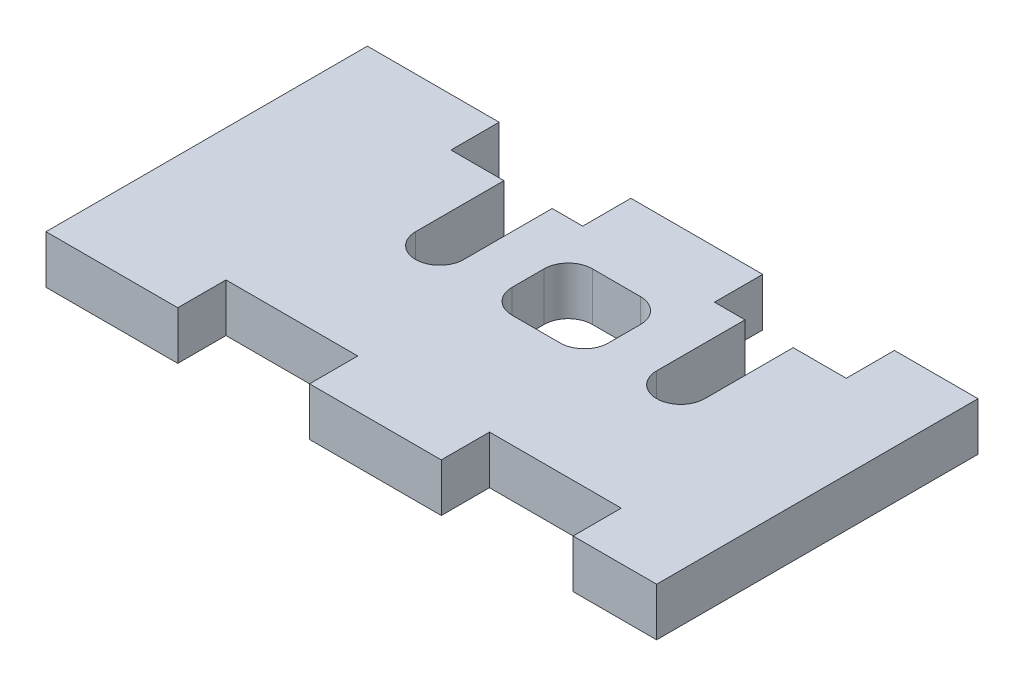
ISO-10303-21;
HEADER;
FILE_DESCRIPTION(('STEP AP214'),'2;1');
FILE_NAME('part.step','',(''),(''),'','','');
FILE_SCHEMA(('AUTOMOTIVE_DESIGN { 1 0 10303 214 1 1 1 1 }'));
ENDSEC;
DATA;
#1=APPLICATION_CONTEXT('core data for automotive mechanical design processes');
#2=APPLICATION_PROTOCOL_DEFINITION('international standard','automotive_design',2000,#1);
#3=PRODUCT_CONTEXT('',#1,'mechanical');
#4=PRODUCT('Part','Part','',(#3));
#5=PRODUCT_RELATED_PRODUCT_CATEGORY('part','',(#4));
#6=PRODUCT_DEFINITION_FORMATION('','',#4);
#7=PRODUCT_DEFINITION_CONTEXT('part definition',#1,'design');
#8=PRODUCT_DEFINITION('design','',#6,#7);
#9=PRODUCT_DEFINITION_SHAPE('','',#8);
#10=(LENGTH_UNIT() NAMED_UNIT(*) SI_UNIT(.MILLI.,.METRE.));
#11=(NAMED_UNIT(*) PLANE_ANGLE_UNIT() SI_UNIT($,.RADIAN.));
#12=(NAMED_UNIT(*) SI_UNIT($,.STERADIAN.) SOLID_ANGLE_UNIT());
#13=UNCERTAINTY_MEASURE_WITH_UNIT(LENGTH_MEASURE(1.E-05),#10,'distance_accuracy_value','');
#14=(GEOMETRIC_REPRESENTATION_CONTEXT(3) GLOBAL_UNCERTAINTY_ASSIGNED_CONTEXT((#13)) GLOBAL_UNIT_ASSIGNED_CONTEXT((#10,
#11,#12)) REPRESENTATION_CONTEXT('',''));
#15=CARTESIAN_POINT('',(0.,0.,0.));
#16=DIRECTION('',(0.,0.,1.));
#17=DIRECTION('',(1.,0.,0.));
#18=AXIS2_PLACEMENT_3D('',#15,#16,#17);
#19=CARTESIAN_POINT('',(24.599646,3.,-17.000006));
#20=DIRECTION('',(0.,0.,1.));
#21=DIRECTION('',(1.,0.,0.));
#22=AXIS2_PLACEMENT_3D('',#19,#20,#21);
#23=PLANE('',#22);
#24=DIRECTION('',(-1.,0.,0.));
#25=VECTOR('',#24,1.);
#26=CARTESIAN_POINT('',(24.599646,3.,-17.000006));
#27=LINE('',#26,#25);
#28=CARTESIAN_POINT('',(26.499959,3.,-17.000006));
#29=VERTEX_POINT('',#28);
#30=CARTESIAN_POINT('',(24.599646,3.,-17.000006));
#31=VERTEX_POINT('',#30);
#32=EDGE_CURVE('E472',#29,#31,#27,.T.);
#33=ORIENTED_EDGE('',*,*,#32,.F.);
#34=DIRECTION('',(0.,1.,0.));
#35=VECTOR('',#34,1.);
#36=CARTESIAN_POINT('',(26.499959,3.001,-17.000006));
#37=LINE('',#36,#35);
#38=CARTESIAN_POINT('',(26.499959,0.,-17.000006));
#39=VERTEX_POINT('',#38);
#40=EDGE_CURVE('E681',#39,#29,#37,.T.);
#41=ORIENTED_EDGE('',*,*,#40,.F.);
#42=DIRECTION('',(-1.,0.,0.));
#43=VECTOR('',#42,1.);
#44=CARTESIAN_POINT('',(24.599646,0.,-17.000006));
#45=LINE('',#44,#43);
#46=CARTESIAN_POINT('',(24.599646,0.,-17.000006));
#47=VERTEX_POINT('',#46);
#48=EDGE_CURVE('E395',#39,#47,#45,.T.);
#49=ORIENTED_EDGE('',*,*,#48,.T.);
#50=DIRECTION('',(0.,-1.,0.));
#51=VECTOR('',#50,1.);
#52=CARTESIAN_POINT('',(24.599646,3.,-17.000006));
#53=LINE('',#52,#51);
#54=EDGE_CURVE('E321',#31,#47,#53,.T.);
#55=ORIENTED_EDGE('',*,*,#54,.F.);
#56=EDGE_LOOP('',(#33,#41,#49,#55));
#57=FACE_BOUND('',#56,.T.);
#58=ADVANCED_FACE('F32',(#57),#23,.F.);
#59=CARTESIAN_POINT('',(8.19937400000001,3.,-17.000006));
#60=DIRECTION('',(0.,0.,1.));
#61=DIRECTION('',(1.,0.,0.));
#62=AXIS2_PLACEMENT_3D('',#59,#60,#61);
#63=PLANE('',#62);
#64=DIRECTION('',(-1.,0.,0.));
#65=VECTOR('',#64,1.);
#66=CARTESIAN_POINT('',(8.19937400000001,0.,-17.000006));
#67=LINE('',#66,#65);
#68=CARTESIAN_POINT('',(16.400272,0.,-17.000006));
#69=VERTEX_POINT('',#68);
#70=CARTESIAN_POINT('',(14.499959,0.,-17.000006));
#71=VERTEX_POINT('',#70);
#72=EDGE_CURVE('E291',#69,#71,#67,.T.);
#73=ORIENTED_EDGE('',*,*,#72,.T.);
#74=DIRECTION('',(0.,-1.,0.));
#75=VECTOR('',#74,1.);
#76=CARTESIAN_POINT('',(14.499959,3.001,-17.000006));
#77=LINE('',#76,#75);
#78=CARTESIAN_POINT('',(14.499959,3.,-17.000006));
#79=VERTEX_POINT('',#78);
#80=EDGE_CURVE('E282',#79,#71,#77,.T.);
#81=ORIENTED_EDGE('',*,*,#80,.F.);
#82=DIRECTION('',(-1.,0.,0.));
#83=VECTOR('',#82,1.);
#84=CARTESIAN_POINT('',(8.19937400000001,3.,-17.000006));
#85=LINE('',#84,#83);
#86=CARTESIAN_POINT('',(16.400272,3.,-17.000006));
#87=VERTEX_POINT('',#86);
#88=EDGE_CURVE('E421',#87,#79,#85,.T.);
#89=ORIENTED_EDGE('',*,*,#88,.F.);
#90=DIRECTION('',(0.,-1.,0.));
#91=VECTOR('',#90,1.);
#92=CARTESIAN_POINT('',(16.400272,3.,-17.000006));
#93=LINE('',#92,#91);
#94=EDGE_CURVE('E312',#87,#69,#93,.T.);
#95=ORIENTED_EDGE('',*,*,#94,.T.);
#96=EDGE_LOOP('',(#73,#81,#89,#95));
#97=FACE_BOUND('',#96,.T.);
#98=ADVANCED_FACE('F418',(#97),#63,.F.);
#99=CARTESIAN_POINT('',(0.,3.,0.));
#100=DIRECTION('',(1.,0.,0.));
#101=DIRECTION('',(0.,0.,-1.));
#102=AXIS2_PLACEMENT_3D('',#99,#100,#101);
#103=PLANE('',#102);
#104=DIRECTION('',(0.,0.,1.));
#105=VECTOR('',#104,1.);
#106=CARTESIAN_POINT('',(0.,0.,0.));
#107=LINE('',#106,#105);
#108=CARTESIAN_POINT('',(0.,0.,-20.));
#109=VERTEX_POINT('',#108);
#110=CARTESIAN_POINT('',(0.,0.,0.));
#111=VERTEX_POINT('',#110);
#112=EDGE_CURVE('E374',#109,#111,#107,.T.);
#113=ORIENTED_EDGE('',*,*,#112,.T.);
#114=DIRECTION('',(0.,-1.,0.));
#115=VECTOR('',#114,1.);
#116=CARTESIAN_POINT('',(0.,3.,0.));
#117=LINE('',#116,#115);
#118=CARTESIAN_POINT('',(0.,3.,0.));
#119=VERTEX_POINT('',#118);
#120=EDGE_CURVE('E11',#119,#111,#117,.T.);
#121=ORIENTED_EDGE('',*,*,#120,.F.);
#122=DIRECTION('',(0.,0.,1.));
#123=VECTOR('',#122,1.);
#124=CARTESIAN_POINT('',(0.,3.,0.));
#125=LINE('',#124,#123);
#126=CARTESIAN_POINT('',(0.,3.,-20.));
#127=VERTEX_POINT('',#126);
#128=EDGE_CURVE('E302',#127,#119,#125,.T.);
#129=ORIENTED_EDGE('',*,*,#128,.F.);
#130=DIRECTION('',(0.,-1.,0.));
#131=VECTOR('',#130,1.);
#132=CARTESIAN_POINT('',(0.,3.,-20.));
#133=LINE('',#132,#131);
#134=EDGE_CURVE('E303',#127,#109,#133,.T.);
#135=ORIENTED_EDGE('',*,*,#134,.T.);
#136=EDGE_LOOP('',(#113,#121,#129,#135));
#137=FACE_BOUND('',#136,.T.);
#138=ADVANCED_FACE('F34',(#137),#103,.F.);
#139=CARTESIAN_POINT('',(0.,3.,0.));
#140=DIRECTION('',(0.,0.,-1.));
#141=DIRECTION('',(-1.,0.,0.));
#142=AXIS2_PLACEMENT_3D('',#139,#140,#141);
#143=PLANE('',#142);
#144=DIRECTION('',(1.,0.,0.));
#145=VECTOR('',#144,1.);
#146=CARTESIAN_POINT('',(0.,0.,0.));
#147=LINE('',#146,#145);
#148=CARTESIAN_POINT('',(8.19937400000001,0.,0.));
#149=VERTEX_POINT('',#148);
#150=EDGE_CURVE('E368',#111,#149,#147,.T.);
#151=ORIENTED_EDGE('',*,*,#150,.T.);
#152=DIRECTION('',(0.,-1.,0.));
#153=VECTOR('',#152,1.);
#154=CARTESIAN_POINT('',(8.19937400000001,3.,0.));
#155=LINE('',#154,#153);
#156=CARTESIAN_POINT('',(8.19937400000001,3.,0.));
#157=VERTEX_POINT('',#156);
#158=EDGE_CURVE('E40',#157,#149,#155,.T.);
#159=ORIENTED_EDGE('',*,*,#158,.F.);
#160=DIRECTION('',(1.,0.,0.));
#161=VECTOR('',#160,1.);
#162=CARTESIAN_POINT('',(0.,3.,0.));
#163=LINE('',#162,#161);
#164=EDGE_CURVE('E449',#119,#157,#163,.T.);
#165=ORIENTED_EDGE('',*,*,#164,.F.);
#166=ORIENTED_EDGE('',*,*,#120,.T.);
#167=EDGE_LOOP('',(#151,#159,#165,#166));
#168=FACE_BOUND('',#167,.T.);
#169=ADVANCED_FACE('F731',(#168),#143,.F.);
#170=CARTESIAN_POINT('',(8.19937400000001,3.,-3.00024800000001));
#171=DIRECTION('',(-1.,0.,0.));
#172=DIRECTION('',(0.,0.,1.));
#173=AXIS2_PLACEMENT_3D('',#170,#171,#172);
#174=PLANE('',#173);
#175=DIRECTION('',(0.,0.,-1.));
#176=VECTOR('',#175,1.);
#177=CARTESIAN_POINT('',(8.19937400000001,0.,-3.00024800000001));
#178=LINE('',#177,#176);
#179=CARTESIAN_POINT('',(8.19937400000001,0.,-3.00024800000001));
#180=VERTEX_POINT('',#179);
#181=EDGE_CURVE('E363',#149,#180,#178,.T.);
#182=ORIENTED_EDGE('',*,*,#181,.T.);
#183=DIRECTION('',(0.,-1.,0.));
#184=VECTOR('',#183,1.);
#185=CARTESIAN_POINT('',(8.19937400000001,3.,-3.00024800000001));
#186=LINE('',#185,#184);
#187=CARTESIAN_POINT('',(8.19937400000001,3.,-3.00024800000001));
#188=VERTEX_POINT('',#187);
#189=EDGE_CURVE('E354',#188,#180,#186,.T.);
#190=ORIENTED_EDGE('',*,*,#189,.F.);
#191=DIRECTION('',(0.,0.,-1.));
#192=VECTOR('',#191,1.);
#193=CARTESIAN_POINT('',(8.19937400000001,3.,-3.00024800000001));
#194=LINE('',#193,#192);
#195=EDGE_CURVE('E364',#157,#188,#194,.T.);
#196=ORIENTED_EDGE('',*,*,#195,.F.);
#197=ORIENTED_EDGE('',*,*,#158,.T.);
#198=EDGE_LOOP('',(#182,#190,#196,#197));
#199=FACE_BOUND('',#198,.T.);
#200=ADVANCED_FACE('F361',(#199),#174,.F.);
#201=CARTESIAN_POINT('',(8.19937400000001,3.,-3.00024800000001));
#202=DIRECTION('',(0.,0.,-1.));
#203=DIRECTION('',(-1.,0.,0.));
#204=AXIS2_PLACEMENT_3D('',#201,#202,#203);
#205=PLANE('',#204);
#206=DIRECTION('',(1.,0.,0.));
#207=VECTOR('',#206,1.);
#208=CARTESIAN_POINT('',(8.19937400000001,0.,-3.00024800000001));
#209=LINE('',#208,#207);
#210=CARTESIAN_POINT('',(16.400272,0.,-3.00024800000001));
#211=VERTEX_POINT('',#210);
#212=EDGE_CURVE('E370',#180,#211,#209,.T.);
#213=ORIENTED_EDGE('',*,*,#212,.T.);
#214=DIRECTION('',(0.,-1.,0.));
#215=VECTOR('',#214,1.);
#216=CARTESIAN_POINT('',(16.400272,3.,-3.00024800000001));
#217=LINE('',#216,#215);
#218=CARTESIAN_POINT('',(16.400272,3.,-3.00024800000001));
#219=VERTEX_POINT('',#218);
#220=EDGE_CURVE('E351',#219,#211,#217,.T.);
#221=ORIENTED_EDGE('',*,*,#220,.F.);
#222=DIRECTION('',(1.,0.,0.));
#223=VECTOR('',#222,1.);
#224=CARTESIAN_POINT('',(8.19937400000001,3.,-3.00024800000001));
#225=LINE('',#224,#223);
#226=EDGE_CURVE('E452',#188,#219,#225,.T.);
#227=ORIENTED_EDGE('',*,*,#226,.F.);
#228=ORIENTED_EDGE('',*,*,#189,.T.);
#229=EDGE_LOOP('',(#213,#221,#227,#228));
#230=FACE_BOUND('',#229,.T.);
#231=ADVANCED_FACE('F729',(#230),#205,.F.);
#232=CARTESIAN_POINT('',(16.400272,3.,-3.00024800000001));
#233=DIRECTION('',(1.,0.,0.));
#234=DIRECTION('',(0.,0.,-1.));
#235=AXIS2_PLACEMENT_3D('',#232,#233,#234);
#236=PLANE('',#235);
#237=DIRECTION('',(0.,0.,1.));
#238=VECTOR('',#237,1.);
#239=CARTESIAN_POINT('',(16.400272,0.,-3.00024800000001));
#240=LINE('',#239,#238);
#241=CARTESIAN_POINT('',(16.400272,0.,0.));
#242=VERTEX_POINT('',#241);
#243=EDGE_CURVE('E372',#211,#242,#240,.T.);
#244=ORIENTED_EDGE('',*,*,#243,.T.);
#245=DIRECTION('',(0.,-1.,0.));
#246=VECTOR('',#245,1.);
#247=CARTESIAN_POINT('',(16.400272,3.,0.));
#248=LINE('',#247,#246);
#249=CARTESIAN_POINT('',(16.400272,3.,0.));
#250=VERTEX_POINT('',#249);
#251=EDGE_CURVE('E348',#250,#242,#248,.T.);
#252=ORIENTED_EDGE('',*,*,#251,.F.);
#253=DIRECTION('',(0.,0.,1.));
#254=VECTOR('',#253,1.);
#255=CARTESIAN_POINT('',(16.400272,3.,-3.00024800000001));
#256=LINE('',#255,#254);
#257=EDGE_CURVE('E454',#219,#250,#256,.T.);
#258=ORIENTED_EDGE('',*,*,#257,.F.);
#259=ORIENTED_EDGE('',*,*,#220,.T.);
#260=EDGE_LOOP('',(#244,#252,#258,#259));
#261=FACE_BOUND('',#260,.T.);
#262=ADVANCED_FACE('F724',(#261),#236,.F.);
#263=CARTESIAN_POINT('',(16.400272,3.,0.));
#264=DIRECTION('',(0.,0.,-1.));
#265=DIRECTION('',(-1.,0.,0.));
#266=AXIS2_PLACEMENT_3D('',#263,#264,#265);
#267=PLANE('',#266);
#268=DIRECTION('',(1.,0.,0.));
#269=VECTOR('',#268,1.);
#270=CARTESIAN_POINT('',(16.400272,0.,0.));
#271=LINE('',#270,#269);
#272=CARTESIAN_POINT('',(24.599646,0.,0.));
#273=VERTEX_POINT('',#272);
#274=EDGE_CURVE('E379',#242,#273,#271,.T.);
#275=ORIENTED_EDGE('',*,*,#274,.T.);
#276=DIRECTION('',(0.,-1.,0.));
#277=VECTOR('',#276,1.);
#278=CARTESIAN_POINT('',(24.599646,3.,0.));
#279=LINE('',#278,#277);
#280=CARTESIAN_POINT('',(24.599646,3.,0.));
#281=VERTEX_POINT('',#280);
#282=EDGE_CURVE('E345',#281,#273,#279,.T.);
#283=ORIENTED_EDGE('',*,*,#282,.F.);
#284=DIRECTION('',(1.,0.,0.));
#285=VECTOR('',#284,1.);
#286=CARTESIAN_POINT('',(16.400272,3.,0.));
#287=LINE('',#286,#285);
#288=EDGE_CURVE('E456',#250,#281,#287,.T.);
#289=ORIENTED_EDGE('',*,*,#288,.F.);
#290=ORIENTED_EDGE('',*,*,#251,.T.);
#291=EDGE_LOOP('',(#275,#283,#289,#290));
#292=FACE_BOUND('',#291,.T.);
#293=ADVANCED_FACE('F721',(#292),#267,.F.);
#294=CARTESIAN_POINT('',(24.599646,3.,-3.00024800000001));
#295=DIRECTION('',(-1.,0.,0.));
#296=DIRECTION('',(0.,0.,1.));
#297=AXIS2_PLACEMENT_3D('',#294,#295,#296);
#298=PLANE('',#297);
#299=DIRECTION('',(0.,0.,-1.));
#300=VECTOR('',#299,1.);
#301=CARTESIAN_POINT('',(24.599646,0.,-3.00024800000001));
#302=LINE('',#301,#300);
#303=CARTESIAN_POINT('',(24.599646,0.,-3.00024800000001));
#304=VERTEX_POINT('',#303);
#305=EDGE_CURVE('E381',#273,#304,#302,.T.);
#306=ORIENTED_EDGE('',*,*,#305,.T.);
#307=DIRECTION('',(0.,-1.,0.));
#308=VECTOR('',#307,1.);
#309=CARTESIAN_POINT('',(24.599646,3.,-3.00024800000001));
#310=LINE('',#309,#308);
#311=CARTESIAN_POINT('',(24.599646,3.,-3.00024800000001));
#312=VERTEX_POINT('',#311);
#313=EDGE_CURVE('E342',#312,#304,#310,.T.);
#314=ORIENTED_EDGE('',*,*,#313,.F.);
#315=DIRECTION('',(0.,0.,-1.));
#316=VECTOR('',#315,1.);
#317=CARTESIAN_POINT('',(24.599646,3.,-3.00024800000001));
#318=LINE('',#317,#316);
#319=EDGE_CURVE('E458',#281,#312,#318,.T.);
#320=ORIENTED_EDGE('',*,*,#319,.F.);
#321=ORIENTED_EDGE('',*,*,#282,.T.);
#322=EDGE_LOOP('',(#306,#314,#320,#321));
#323=FACE_BOUND('',#322,.T.);
#324=ADVANCED_FACE('F717',(#323),#298,.F.);
#325=CARTESIAN_POINT('',(24.599646,3.,-3.00024800000001));
#326=DIRECTION('',(0.,0.,-1.));
#327=DIRECTION('',(-1.,0.,0.));
#328=AXIS2_PLACEMENT_3D('',#325,#326,#327);
#329=PLANE('',#328);
#330=DIRECTION('',(1.,0.,0.));
#331=VECTOR('',#330,1.);
#332=CARTESIAN_POINT('',(24.599646,0.,-3.00024800000001));
#333=LINE('',#332,#331);
#334=CARTESIAN_POINT('',(32.80029,0.,-3.00024800000001));
#335=VERTEX_POINT('',#334);
#336=EDGE_CURVE('E383',#304,#335,#333,.T.);
#337=ORIENTED_EDGE('',*,*,#336,.T.);
#338=DIRECTION('',(0.,-1.,0.));
#339=VECTOR('',#338,1.);
#340=CARTESIAN_POINT('',(32.80029,3.,-3.00024800000001));
#341=LINE('',#340,#339);
#342=CARTESIAN_POINT('',(32.80029,3.,-3.00024800000001));
#343=VERTEX_POINT('',#342);
#344=EDGE_CURVE('E339',#343,#335,#341,.T.);
#345=ORIENTED_EDGE('',*,*,#344,.F.);
#346=DIRECTION('',(1.,0.,0.));
#347=VECTOR('',#346,1.);
#348=CARTESIAN_POINT('',(24.599646,3.,-3.00024800000001));
#349=LINE('',#348,#347);
#350=EDGE_CURVE('E460',#312,#343,#349,.T.);
#351=ORIENTED_EDGE('',*,*,#350,.F.);
#352=ORIENTED_EDGE('',*,*,#313,.T.);
#353=EDGE_LOOP('',(#337,#345,#351,#352));
#354=FACE_BOUND('',#353,.T.);
#355=ADVANCED_FACE('F712',(#354),#329,.F.);
#356=CARTESIAN_POINT('',(32.80029,3.,-3.00024800000001));
#357=DIRECTION('',(1.,0.,0.));
#358=DIRECTION('',(0.,0.,-1.));
#359=AXIS2_PLACEMENT_3D('',#356,#357,#358);
#360=PLANE('',#359);
#361=DIRECTION('',(0.,0.,1.));
#362=VECTOR('',#361,1.);
#363=CARTESIAN_POINT('',(32.80029,0.,-3.00024800000001));
#364=LINE('',#363,#362);
#365=CARTESIAN_POINT('',(32.80029,0.,0.));
#366=VERTEX_POINT('',#365);
#367=EDGE_CURVE('E385',#335,#366,#364,.T.);
#368=ORIENTED_EDGE('',*,*,#367,.T.);
#369=DIRECTION('',(0.,-1.,0.));
#370=VECTOR('',#369,1.);
#371=CARTESIAN_POINT('',(32.80029,3.,0.));
#372=LINE('',#371,#370);
#373=CARTESIAN_POINT('',(32.80029,3.,0.));
#374=VERTEX_POINT('',#373);
#375=EDGE_CURVE('E336',#374,#366,#372,.T.);
#376=ORIENTED_EDGE('',*,*,#375,.F.);
#377=DIRECTION('',(0.,0.,1.));
#378=VECTOR('',#377,1.);
#379=CARTESIAN_POINT('',(32.80029,3.,-3.00024800000001));
#380=LINE('',#379,#378);
#381=EDGE_CURVE('E462',#343,#374,#380,.T.);
#382=ORIENTED_EDGE('',*,*,#381,.F.);
#383=ORIENTED_EDGE('',*,*,#344,.T.);
#384=EDGE_LOOP('',(#368,#376,#382,#383));
#385=FACE_BOUND('',#384,.T.);
#386=ADVANCED_FACE('F706',(#385),#360,.F.);
#387=CARTESIAN_POINT('',(32.80029,3.,0.));
#388=DIRECTION('',(0.,0.,-1.));
#389=DIRECTION('',(-1.,0.,0.));
#390=AXIS2_PLACEMENT_3D('',#387,#388,#389);
#391=PLANE('',#390);
#392=DIRECTION('',(1.,0.,0.));
#393=VECTOR('',#392,1.);
#394=CARTESIAN_POINT('',(32.80029,0.,0.));
#395=LINE('',#394,#393);
#396=CARTESIAN_POINT('',(37.999416,0.,0.));
#397=VERTEX_POINT('',#396);
#398=EDGE_CURVE('E387',#366,#397,#395,.T.);
#399=ORIENTED_EDGE('',*,*,#398,.T.);
#400=DIRECTION('',(0.,-1.,0.));
#401=VECTOR('',#400,1.);
#402=CARTESIAN_POINT('',(37.999416,3.,0.));
#403=LINE('',#402,#401);
#404=CARTESIAN_POINT('',(37.999416,3.,0.));
#405=VERTEX_POINT('',#404);
#406=EDGE_CURVE('E333',#405,#397,#403,.T.);
#407=ORIENTED_EDGE('',*,*,#406,.F.);
#408=DIRECTION('',(1.,0.,0.));
#409=VECTOR('',#408,1.);
#410=CARTESIAN_POINT('',(32.80029,3.,0.));
#411=LINE('',#410,#409);
#412=EDGE_CURVE('E464',#374,#405,#411,.T.);
#413=ORIENTED_EDGE('',*,*,#412,.F.);
#414=ORIENTED_EDGE('',*,*,#375,.T.);
#415=EDGE_LOOP('',(#399,#407,#413,#414));
#416=FACE_BOUND('',#415,.T.);
#417=ADVANCED_FACE('F702',(#416),#391,.F.);
#418=CARTESIAN_POINT('',(37.999416,3.,0.));
#419=DIRECTION('',(-1.,0.,0.));
#420=DIRECTION('',(0.,0.,1.));
#421=AXIS2_PLACEMENT_3D('',#418,#419,#420);
#422=PLANE('',#421);
#423=DIRECTION('',(0.,0.,-1.));
#424=VECTOR('',#423,1.);
#425=CARTESIAN_POINT('',(37.999416,0.,0.));
#426=LINE('',#425,#424);
#427=CARTESIAN_POINT('',(37.999416,0.,-20.));
#428=VERTEX_POINT('',#427);
#429=EDGE_CURVE('E389',#397,#428,#426,.T.);
#430=ORIENTED_EDGE('',*,*,#429,.T.);
#431=DIRECTION('',(0.,-1.,0.));
#432=VECTOR('',#431,1.);
#433=CARTESIAN_POINT('',(37.999416,3.,-20.));
#434=LINE('',#433,#432);
#435=CARTESIAN_POINT('',(37.999416,3.,-20.));
#436=VERTEX_POINT('',#435);
#437=EDGE_CURVE('E330',#436,#428,#434,.T.);
#438=ORIENTED_EDGE('',*,*,#437,.F.);
#439=DIRECTION('',(0.,0.,-1.));
#440=VECTOR('',#439,1.);
#441=CARTESIAN_POINT('',(37.999416,3.,0.));
#442=LINE('',#441,#440);
#443=EDGE_CURVE('E466',#405,#436,#442,.T.);
#444=ORIENTED_EDGE('',*,*,#443,.F.);
#445=ORIENTED_EDGE('',*,*,#406,.T.);
#446=EDGE_LOOP('',(#430,#438,#444,#445));
#447=FACE_BOUND('',#446,.T.);
#448=ADVANCED_FACE('F697',(#447),#422,.F.);
#449=CARTESIAN_POINT('',(32.80029,3.,-20.));
#450=DIRECTION('',(0.,0.,1.));
#451=DIRECTION('',(1.,0.,0.));
#452=AXIS2_PLACEMENT_3D('',#449,#450,#451);
#453=PLANE('',#452);
#454=DIRECTION('',(-1.,0.,0.));
#455=VECTOR('',#454,1.);
#456=CARTESIAN_POINT('',(32.80029,0.,-20.));
#457=LINE('',#456,#455);
#458=CARTESIAN_POINT('',(32.80029,0.,-20.));
#459=VERTEX_POINT('',#458);
#460=EDGE_CURVE('E391',#428,#459,#457,.T.);
#461=ORIENTED_EDGE('',*,*,#460,.T.);
#462=DIRECTION('',(0.,-1.,0.));
#463=VECTOR('',#462,1.);
#464=CARTESIAN_POINT('',(32.80029,3.,-20.));
#465=LINE('',#464,#463);
#466=CARTESIAN_POINT('',(32.80029,3.,-20.));
#467=VERTEX_POINT('',#466);
#468=EDGE_CURVE('E327',#467,#459,#465,.T.);
#469=ORIENTED_EDGE('',*,*,#468,.F.);
#470=DIRECTION('',(-1.,0.,0.));
#471=VECTOR('',#470,1.);
#472=CARTESIAN_POINT('',(32.80029,3.,-20.));
#473=LINE('',#472,#471);
#474=EDGE_CURVE('E468',#436,#467,#473,.T.);
#475=ORIENTED_EDGE('',*,*,#474,.F.);
#476=ORIENTED_EDGE('',*,*,#437,.T.);
#477=EDGE_LOOP('',(#461,#469,#475,#476));
#478=FACE_BOUND('',#477,.T.);
#479=ADVANCED_FACE('F518',(#478),#453,.F.);
#480=CARTESIAN_POINT('',(32.80029,3.,-20.));
#481=DIRECTION('',(1.,0.,0.));
#482=DIRECTION('',(0.,0.,-1.));
#483=AXIS2_PLACEMENT_3D('',#480,#481,#482);
#484=PLANE('',#483);
#485=DIRECTION('',(0.,0.,1.));
#486=VECTOR('',#485,1.);
#487=CARTESIAN_POINT('',(32.80029,0.,-20.));
#488=LINE('',#487,#486);
#489=CARTESIAN_POINT('',(32.80029,0.,-17.000006));
#490=VERTEX_POINT('',#489);
#491=EDGE_CURVE('E393',#459,#490,#488,.T.);
#492=ORIENTED_EDGE('',*,*,#491,.T.);
#493=DIRECTION('',(0.,-1.,0.));
#494=VECTOR('',#493,1.);
#495=CARTESIAN_POINT('',(32.80029,3.,-17.000006));
#496=LINE('',#495,#494);
#497=CARTESIAN_POINT('',(32.80029,3.,-17.000006));
#498=VERTEX_POINT('',#497);
#499=EDGE_CURVE('E324',#498,#490,#496,.T.);
#500=ORIENTED_EDGE('',*,*,#499,.F.);
#501=DIRECTION('',(0.,0.,1.));
#502=VECTOR('',#501,1.);
#503=CARTESIAN_POINT('',(32.80029,3.,-20.));
#504=LINE('',#503,#502);
#505=EDGE_CURVE('E470',#467,#498,#504,.T.);
#506=ORIENTED_EDGE('',*,*,#505,.F.);
#507=ORIENTED_EDGE('',*,*,#468,.T.);
#508=EDGE_LOOP('',(#492,#500,#506,#507));
#509=FACE_BOUND('',#508,.T.);
#510=ADVANCED_FACE('F511',(#509),#484,.F.);
#511=CARTESIAN_POINT('',(29.499959,0.,-17.000006));
#512=VERTEX_POINT('',#511);
#513=EDGE_CURVE('E396',#490,#512,#45,.T.);
#514=ORIENTED_EDGE('',*,*,#513,.T.);
#515=DIRECTION('',(0.,-1.,0.));
#516=VECTOR('',#515,1.);
#517=CARTESIAN_POINT('',(29.499959,3.001,-17.000006));
#518=LINE('',#517,#516);
#519=CARTESIAN_POINT('',(29.499959,3.,-17.000006));
#520=VERTEX_POINT('',#519);
#521=EDGE_CURVE('E523',#520,#512,#518,.T.);
#522=ORIENTED_EDGE('',*,*,#521,.F.);
#523=EDGE_CURVE('E473',#498,#520,#27,.T.);
#524=ORIENTED_EDGE('',*,*,#523,.F.);
#525=ORIENTED_EDGE('',*,*,#499,.T.);
#526=EDGE_LOOP('',(#514,#522,#524,#525));
#527=FACE_BOUND('',#526,.T.);
#528=ADVANCED_FACE('F501',(#527),#23,.F.);
#529=CARTESIAN_POINT('',(24.599646,3.,-20.));
#530=DIRECTION('',(-1.,0.,0.));
#531=DIRECTION('',(0.,0.,1.));
#532=AXIS2_PLACEMENT_3D('',#529,#530,#531);
#533=PLANE('',#532);
#534=DIRECTION('',(0.,0.,-1.));
#535=VECTOR('',#534,1.);
#536=CARTESIAN_POINT('',(24.599646,0.,-20.));
#537=LINE('',#536,#535);
#538=CARTESIAN_POINT('',(24.599646,0.,-20.));
#539=VERTEX_POINT('',#538);
#540=EDGE_CURVE('E399',#47,#539,#537,.T.);
#541=ORIENTED_EDGE('',*,*,#540,.T.);
#542=DIRECTION('',(0.,-1.,0.));
#543=VECTOR('',#542,1.);
#544=CARTESIAN_POINT('',(24.599646,3.,-20.));
#545=LINE('',#544,#543);
#546=CARTESIAN_POINT('',(24.599646,3.,-20.));
#547=VERTEX_POINT('',#546);
#548=EDGE_CURVE('E318',#547,#539,#545,.T.);
#549=ORIENTED_EDGE('',*,*,#548,.F.);
#550=DIRECTION('',(0.,0.,-1.));
#551=VECTOR('',#550,1.);
#552=CARTESIAN_POINT('',(24.599646,3.,-20.));
#553=LINE('',#552,#551);
#554=EDGE_CURVE('E476',#31,#547,#553,.T.);
#555=ORIENTED_EDGE('',*,*,#554,.F.);
#556=ORIENTED_EDGE('',*,*,#54,.T.);
#557=EDGE_LOOP('',(#541,#549,#555,#556));
#558=FACE_BOUND('',#557,.T.);
#559=ADVANCED_FACE('F510',(#558),#533,.F.);
#560=CARTESIAN_POINT('',(16.400272,3.,-20.));
#561=DIRECTION('',(0.,0.,1.));
#562=DIRECTION('',(1.,0.,0.));
#563=AXIS2_PLACEMENT_3D('',#560,#561,#562);
#564=PLANE('',#563);
#565=DIRECTION('',(-1.,0.,0.));
#566=VECTOR('',#565,1.);
#567=CARTESIAN_POINT('',(16.400272,0.,-20.));
#568=LINE('',#567,#566);
#569=CARTESIAN_POINT('',(16.400272,0.,-20.));
#570=VERTEX_POINT('',#569);
#571=EDGE_CURVE('E295',#539,#570,#568,.T.);
#572=ORIENTED_EDGE('',*,*,#571,.T.);
#573=DIRECTION('',(0.,-1.,0.));
#574=VECTOR('',#573,1.);
#575=CARTESIAN_POINT('',(16.400272,3.,-20.));
#576=LINE('',#575,#574);
#577=CARTESIAN_POINT('',(16.400272,3.,-20.));
#578=VERTEX_POINT('',#577);
#579=EDGE_CURVE('E315',#578,#570,#576,.T.);
#580=ORIENTED_EDGE('',*,*,#579,.F.);
#581=DIRECTION('',(-1.,0.,0.));
#582=VECTOR('',#581,1.);
#583=CARTESIAN_POINT('',(16.400272,3.,-20.));
#584=LINE('',#583,#582);
#585=EDGE_CURVE('E477',#547,#578,#584,.T.);
#586=ORIENTED_EDGE('',*,*,#585,.F.);
#587=ORIENTED_EDGE('',*,*,#548,.T.);
#588=EDGE_LOOP('',(#572,#580,#586,#587));
#589=FACE_BOUND('',#588,.T.);
#590=ADVANCED_FACE('F403',(#589),#564,.F.);
#591=CARTESIAN_POINT('',(16.400272,3.,-20.));
#592=DIRECTION('',(1.,0.,0.));
#593=DIRECTION('',(0.,0.,-1.));
#594=AXIS2_PLACEMENT_3D('',#591,#592,#593);
#595=PLANE('',#594);
#596=DIRECTION('',(0.,0.,1.));
#597=VECTOR('',#596,1.);
#598=CARTESIAN_POINT('',(16.400272,0.,-20.));
#599=LINE('',#598,#597);
#600=EDGE_CURVE('E292',#570,#69,#599,.T.);
#601=ORIENTED_EDGE('',*,*,#600,.T.);
#602=ORIENTED_EDGE('',*,*,#94,.F.);
#603=DIRECTION('',(0.,0.,1.));
#604=VECTOR('',#603,1.);
#605=CARTESIAN_POINT('',(16.400272,3.,-20.));
#606=LINE('',#605,#604);
#607=EDGE_CURVE('E412',#578,#87,#606,.T.);
#608=ORIENTED_EDGE('',*,*,#607,.F.);
#609=ORIENTED_EDGE('',*,*,#579,.T.);
#610=EDGE_LOOP('',(#601,#602,#608,#609));
#611=FACE_BOUND('',#610,.T.);
#612=ADVANCED_FACE('F410',(#611),#595,.F.);
#613=CARTESIAN_POINT('',(11.499959,3.,-17.000006));
#614=VERTEX_POINT('',#613);
#615=CARTESIAN_POINT('',(8.19937400000001,3.,-17.000006));
#616=VERTEX_POINT('',#615);
#617=EDGE_CURVE('E281',#614,#616,#85,.T.);
#618=ORIENTED_EDGE('',*,*,#617,.F.);
#619=DIRECTION('',(0.,1.,0.));
#620=VECTOR('',#619,1.);
#621=CARTESIAN_POINT('',(11.499959,3.001,-17.000006));
#622=LINE('',#621,#620);
#623=CARTESIAN_POINT('',(11.499959,0.,-17.000006));
#624=VERTEX_POINT('',#623);
#625=EDGE_CURVE('E268',#624,#614,#622,.T.);
#626=ORIENTED_EDGE('',*,*,#625,.F.);
#627=CARTESIAN_POINT('',(8.19937400000001,0.,-17.000006));
#628=VERTEX_POINT('',#627);
#629=EDGE_CURVE('E279',#624,#628,#67,.T.);
#630=ORIENTED_EDGE('',*,*,#629,.T.);
#631=DIRECTION('',(0.,-1.,0.));
#632=VECTOR('',#631,1.);
#633=CARTESIAN_POINT('',(8.19937400000001,3.,-17.000006));
#634=LINE('',#633,#632);
#635=EDGE_CURVE('E310',#616,#628,#634,.T.);
#636=ORIENTED_EDGE('',*,*,#635,.F.);
#637=EDGE_LOOP('',(#618,#626,#630,#636));
#638=FACE_BOUND('',#637,.T.);
#639=ADVANCED_FACE('F277',(#638),#63,.F.);
#640=CARTESIAN_POINT('',(8.19937400000001,3.,-20.));
#641=DIRECTION('',(-1.,0.,0.));
#642=DIRECTION('',(0.,0.,1.));
#643=AXIS2_PLACEMENT_3D('',#640,#641,#642);
#644=PLANE('',#643);
#645=DIRECTION('',(0.,0.,-1.));
#646=VECTOR('',#645,1.);
#647=CARTESIAN_POINT('',(8.19937400000001,0.,-20.));
#648=LINE('',#647,#646);
#649=CARTESIAN_POINT('',(8.19937400000001,0.,-20.));
#650=VERTEX_POINT('',#649);
#651=EDGE_CURVE('E290',#628,#650,#648,.T.);
#652=ORIENTED_EDGE('',*,*,#651,.T.);
#653=DIRECTION('',(0.,-1.,0.));
#654=VECTOR('',#653,1.);
#655=CARTESIAN_POINT('',(8.19937400000001,3.,-20.));
#656=LINE('',#655,#654);
#657=CARTESIAN_POINT('',(8.19937400000001,3.,-20.));
#658=VERTEX_POINT('',#657);
#659=EDGE_CURVE('E306',#658,#650,#656,.T.);
#660=ORIENTED_EDGE('',*,*,#659,.F.);
#661=DIRECTION('',(0.,0.,-1.));
#662=VECTOR('',#661,1.);
#663=CARTESIAN_POINT('',(8.19937400000001,3.,-20.));
#664=LINE('',#663,#662);
#665=EDGE_CURVE('E424',#616,#658,#664,.T.);
#666=ORIENTED_EDGE('',*,*,#665,.F.);
#667=ORIENTED_EDGE('',*,*,#635,.T.);
#668=EDGE_LOOP('',(#652,#660,#666,#667));
#669=FACE_BOUND('',#668,.T.);
#670=ADVANCED_FACE('F493',(#669),#644,.F.);
#671=CARTESIAN_POINT('',(0.,3.,-20.));
#672=DIRECTION('',(0.,0.,1.));
#673=DIRECTION('',(1.,0.,0.));
#674=AXIS2_PLACEMENT_3D('',#671,#672,#673);
#675=PLANE('',#674);
#676=DIRECTION('',(-1.,0.,0.));
#677=VECTOR('',#676,1.);
#678=CARTESIAN_POINT('',(0.,0.,-20.));
#679=LINE('',#678,#677);
#680=EDGE_CURVE('E300',#650,#109,#679,.T.);
#681=ORIENTED_EDGE('',*,*,#680,.T.);
#682=ORIENTED_EDGE('',*,*,#134,.F.);
#683=DIRECTION('',(-1.,0.,0.));
#684=VECTOR('',#683,1.);
#685=CARTESIAN_POINT('',(0.,3.,-20.));
#686=LINE('',#685,#684);
#687=EDGE_CURVE('E307',#658,#127,#686,.T.);
#688=ORIENTED_EDGE('',*,*,#687,.F.);
#689=ORIENTED_EDGE('',*,*,#659,.T.);
#690=EDGE_LOOP('',(#681,#682,#688,#689));
#691=FACE_BOUND('',#690,.T.);
#692=ADVANCED_FACE('F484',(#691),#675,.F.);
#693=CARTESIAN_POINT('',(0.,3.,0.));
#694=DIRECTION('',(0.,-1.,0.));
#695=DIRECTION('',(0.,0.,-1.));
#696=AXIS2_PLACEMENT_3D('',#693,#694,#695);
#697=PLANE('',#696);
#698=DIRECTION('',(1.,0.,0.));
#699=VECTOR('',#698,1.);
#700=CARTESIAN_POINT('',(18.999959,3.,-10.));
#701=LINE('',#700,#699);
#702=CARTESIAN_POINT('',(18.999959,3.,-10.));
#703=VERTEX_POINT('',#702);
#704=CARTESIAN_POINT('',(21.999959,3.,-10.));
#705=VERTEX_POINT('',#704);
#706=EDGE_CURVE('E561',#703,#705,#701,.T.);
#707=ORIENTED_EDGE('',*,*,#706,.F.);
#708=CARTESIAN_POINT('',(18.999959,3.,-11.5));
#709=DIRECTION('',(0.,-1.,0.));
#710=DIRECTION('',(0.,0.,-1.));
#711=AXIS2_PLACEMENT_3D('',#708,#709,#710);
#712=CIRCLE('',#711,1.5);
#713=CARTESIAN_POINT('',(17.499959,3.,-11.5));
#714=VERTEX_POINT('',#713);
#715=EDGE_CURVE('E564',#714,#703,#712,.F.);
#716=ORIENTED_EDGE('',*,*,#715,.F.);
#717=DIRECTION('',(0.,0.,1.));
#718=VECTOR('',#717,1.);
#719=CARTESIAN_POINT('',(17.499959,3.,-13.500006));
#720=LINE('',#719,#718);
#721=CARTESIAN_POINT('',(17.499959,3.,-13.500006));
#722=VERTEX_POINT('',#721);
#723=EDGE_CURVE('E431',#722,#714,#720,.T.);
#724=ORIENTED_EDGE('',*,*,#723,.F.);
#725=CARTESIAN_POINT('',(18.999959,3.,-13.500006));
#726=DIRECTION('',(0.,-1.,0.));
#727=DIRECTION('',(0.,0.,-1.));
#728=AXIS2_PLACEMENT_3D('',#725,#726,#727);
#729=CIRCLE('',#728,1.5);
#730=CARTESIAN_POINT('',(18.999959,3.,-15.000006));
#731=VERTEX_POINT('',#730);
#732=EDGE_CURVE('E47',#731,#722,#729,.F.);
#733=ORIENTED_EDGE('',*,*,#732,.F.);
#734=DIRECTION('',(-1.,0.,0.));
#735=VECTOR('',#734,1.);
#736=CARTESIAN_POINT('',(18.999959,3.,-15.000006));
#737=LINE('',#736,#735);
#738=CARTESIAN_POINT('',(21.999959,3.,-15.000006));
#739=VERTEX_POINT('',#738);
#740=EDGE_CURVE('E548',#739,#731,#737,.T.);
#741=ORIENTED_EDGE('',*,*,#740,.F.);
#742=CARTESIAN_POINT('',(21.999959,3.,-13.500006));
#743=DIRECTION('',(0.,-1.,0.));
#744=DIRECTION('',(0.,0.,-1.));
#745=AXIS2_PLACEMENT_3D('',#742,#743,#744);
#746=CIRCLE('',#745,1.5);
#747=CARTESIAN_POINT('',(23.499959,3.,-13.500006));
#748=VERTEX_POINT('',#747);
#749=EDGE_CURVE('E552',#748,#739,#746,.F.);
#750=ORIENTED_EDGE('',*,*,#749,.F.);
#751=DIRECTION('',(0.,0.,-1.));
#752=VECTOR('',#751,1.);
#753=CARTESIAN_POINT('',(23.499959,3.,-13.500006));
#754=LINE('',#753,#752);
#755=CARTESIAN_POINT('',(23.499959,3.,-11.5));
#756=VERTEX_POINT('',#755);
#757=EDGE_CURVE('E555',#756,#748,#754,.T.);
#758=ORIENTED_EDGE('',*,*,#757,.F.);
#759=CARTESIAN_POINT('',(21.999959,3.,-11.5));
#760=DIRECTION('',(0.,-1.,0.));
#761=DIRECTION('',(0.,0.,-1.));
#762=AXIS2_PLACEMENT_3D('',#759,#760,#761);
#763=CIRCLE('',#762,1.5);
#764=EDGE_CURVE('E558',#705,#756,#763,.F.);
#765=ORIENTED_EDGE('',*,*,#764,.F.);
#766=EDGE_LOOP('',(#707,#716,#724,#733,#741,#750,#758,#765));
#767=FACE_BOUND('',#766,.T.);
#768=CARTESIAN_POINT('',(27.999959,3.,-11.5));
#769=DIRECTION('',(0.,-1.,0.));
#770=DIRECTION('',(0.,0.,-1.));
#771=AXIS2_PLACEMENT_3D('',#768,#769,#770);
#772=CIRCLE('',#771,1.5);
#773=CARTESIAN_POINT('',(26.499959,3.,-11.5));
#774=VERTEX_POINT('',#773);
#775=CARTESIAN_POINT('',(29.499959,3.,-11.5));
#776=VERTEX_POINT('',#775);
#777=EDGE_CURVE('E482',#774,#776,#772,.F.);
#778=ORIENTED_EDGE('',*,*,#777,.F.);
#779=DIRECTION('',(0.,0.,1.));
#780=VECTOR('',#779,1.);
#781=CARTESIAN_POINT('',(26.499959,3.,-20.));
#782=LINE('',#781,#780);
#783=EDGE_CURVE('E539',#29,#774,#782,.T.);
#784=ORIENTED_EDGE('',*,*,#783,.F.);
#785=ORIENTED_EDGE('',*,*,#32,.T.);
#786=ORIENTED_EDGE('',*,*,#554,.T.);
#787=ORIENTED_EDGE('',*,*,#585,.T.);
#788=ORIENTED_EDGE('',*,*,#607,.T.);
#789=ORIENTED_EDGE('',*,*,#88,.T.);
#790=DIRECTION('',(0.,0.,-1.));
#791=VECTOR('',#790,1.);
#792=CARTESIAN_POINT('',(14.499959,3.,-20.));
#793=LINE('',#792,#791);
#794=CARTESIAN_POINT('',(14.499959,3.,-11.5));
#795=VERTEX_POINT('',#794);
#796=EDGE_CURVE('E667',#795,#79,#793,.T.);
#797=ORIENTED_EDGE('',*,*,#796,.F.);
#798=CARTESIAN_POINT('',(12.999959,3.,-11.5));
#799=DIRECTION('',(0.,-1.,0.));
#800=DIRECTION('',(0.,0.,-1.));
#801=AXIS2_PLACEMENT_3D('',#798,#799,#800);
#802=CIRCLE('',#801,1.5);
#803=CARTESIAN_POINT('',(11.499959,3.,-11.5));
#804=VERTEX_POINT('',#803);
#805=EDGE_CURVE('E668',#804,#795,#802,.F.);
#806=ORIENTED_EDGE('',*,*,#805,.F.);
#807=DIRECTION('',(0.,0.,1.));
#808=VECTOR('',#807,1.);
#809=CARTESIAN_POINT('',(11.499959,3.,-20.));
#810=LINE('',#809,#808);
#811=EDGE_CURVE('E549',#614,#804,#810,.T.);
#812=ORIENTED_EDGE('',*,*,#811,.F.);
#813=ORIENTED_EDGE('',*,*,#617,.T.);
#814=ORIENTED_EDGE('',*,*,#665,.T.);
#815=ORIENTED_EDGE('',*,*,#687,.T.);
#816=ORIENTED_EDGE('',*,*,#128,.T.);
#817=ORIENTED_EDGE('',*,*,#164,.T.);
#818=ORIENTED_EDGE('',*,*,#195,.T.);
#819=ORIENTED_EDGE('',*,*,#226,.T.);
#820=ORIENTED_EDGE('',*,*,#257,.T.);
#821=ORIENTED_EDGE('',*,*,#288,.T.);
#822=ORIENTED_EDGE('',*,*,#319,.T.);
#823=ORIENTED_EDGE('',*,*,#350,.T.);
#824=ORIENTED_EDGE('',*,*,#381,.T.);
#825=ORIENTED_EDGE('',*,*,#412,.T.);
#826=ORIENTED_EDGE('',*,*,#443,.T.);
#827=ORIENTED_EDGE('',*,*,#474,.T.);
#828=ORIENTED_EDGE('',*,*,#505,.T.);
#829=ORIENTED_EDGE('',*,*,#523,.T.);
#830=DIRECTION('',(0.,0.,-1.));
#831=VECTOR('',#830,1.);
#832=CARTESIAN_POINT('',(29.499959,3.,-20.));
#833=LINE('',#832,#831);
#834=EDGE_CURVE('E283',#776,#520,#833,.T.);
#835=ORIENTED_EDGE('',*,*,#834,.F.);
#836=EDGE_LOOP('',(#778,#784,#785,#786,#787,#788,#789,#797,#806,#812,#813,#814,#815,#816,#817,
#818,#819,#820,#821,#822,#823,#824,#825,#826,#827,#828,#829,#835));
#837=FACE_BOUND('',#836,.T.);
#838=ADVANCED_FACE('F479',(#767,#837),#697,.F.);
#839=CARTESIAN_POINT('',(0.,0.,0.));
#840=DIRECTION('',(0.,-1.,0.));
#841=DIRECTION('',(0.,0.,-1.));
#842=AXIS2_PLACEMENT_3D('',#839,#840,#841);
#843=PLANE('',#842);
#844=DIRECTION('',(0.,0.,-1.));
#845=VECTOR('',#844,1.);
#846=CARTESIAN_POINT('',(26.499959,0.,-20.));
#847=LINE('',#846,#845);
#848=CARTESIAN_POINT('',(26.499959,0.,-11.5));
#849=VERTEX_POINT('',#848);
#850=EDGE_CURVE('E535',#849,#39,#847,.T.);
#851=ORIENTED_EDGE('',*,*,#850,.F.);
#852=CARTESIAN_POINT('',(27.999959,0.,-11.5));
#853=DIRECTION('',(0.,-1.,0.));
#854=DIRECTION('',(0.,0.,1.));
#855=AXIS2_PLACEMENT_3D('',#852,#853,#854);
#856=CIRCLE('',#855,1.5);
#857=CARTESIAN_POINT('',(29.499959,0.,-11.5));
#858=VERTEX_POINT('',#857);
#859=EDGE_CURVE('E532',#858,#849,#856,.T.);
#860=ORIENTED_EDGE('',*,*,#859,.F.);
#861=DIRECTION('',(0.,0.,1.));
#862=VECTOR('',#861,1.);
#863=CARTESIAN_POINT('',(29.499959,0.,-20.));
#864=LINE('',#863,#862);
#865=EDGE_CURVE('E530',#512,#858,#864,.T.);
#866=ORIENTED_EDGE('',*,*,#865,.F.);
#867=ORIENTED_EDGE('',*,*,#513,.F.);
#868=ORIENTED_EDGE('',*,*,#491,.F.);
#869=ORIENTED_EDGE('',*,*,#460,.F.);
#870=ORIENTED_EDGE('',*,*,#429,.F.);
#871=ORIENTED_EDGE('',*,*,#398,.F.);
#872=ORIENTED_EDGE('',*,*,#367,.F.);
#873=ORIENTED_EDGE('',*,*,#336,.F.);
#874=ORIENTED_EDGE('',*,*,#305,.F.);
#875=ORIENTED_EDGE('',*,*,#274,.F.);
#876=ORIENTED_EDGE('',*,*,#243,.F.);
#877=ORIENTED_EDGE('',*,*,#212,.F.);
#878=ORIENTED_EDGE('',*,*,#181,.F.);
#879=ORIENTED_EDGE('',*,*,#150,.F.);
#880=ORIENTED_EDGE('',*,*,#112,.F.);
#881=ORIENTED_EDGE('',*,*,#680,.F.);
#882=ORIENTED_EDGE('',*,*,#651,.F.);
#883=ORIENTED_EDGE('',*,*,#629,.F.);
#884=DIRECTION('',(0.,0.,-1.));
#885=VECTOR('',#884,1.);
#886=CARTESIAN_POINT('',(11.499959,0.,-20.));
#887=LINE('',#886,#885);
#888=CARTESIAN_POINT('',(11.499959,0.,-11.5));
#889=VERTEX_POINT('',#888);
#890=EDGE_CURVE('E264',#889,#624,#887,.T.);
#891=ORIENTED_EDGE('',*,*,#890,.F.);
#892=CARTESIAN_POINT('',(12.999959,0.,-11.5));
#893=DIRECTION('',(0.,-1.,0.));
#894=DIRECTION('',(0.,0.,-1.));
#895=AXIS2_PLACEMENT_3D('',#892,#893,#894);
#896=CIRCLE('',#895,1.5);
#897=CARTESIAN_POINT('',(14.499959,0.,-11.5));
#898=VERTEX_POINT('',#897);
#899=EDGE_CURVE('E55',#898,#889,#896,.T.);
#900=ORIENTED_EDGE('',*,*,#899,.F.);
#901=DIRECTION('',(0.,0.,1.));
#902=VECTOR('',#901,1.);
#903=CARTESIAN_POINT('',(14.499959,0.,-20.));
#904=LINE('',#903,#902);
#905=EDGE_CURVE('E273',#71,#898,#904,.T.);
#906=ORIENTED_EDGE('',*,*,#905,.F.);
#907=ORIENTED_EDGE('',*,*,#72,.F.);
#908=ORIENTED_EDGE('',*,*,#600,.F.);
#909=ORIENTED_EDGE('',*,*,#571,.F.);
#910=ORIENTED_EDGE('',*,*,#540,.F.);
#911=ORIENTED_EDGE('',*,*,#48,.F.);
#912=EDGE_LOOP('',(#851,#860,#866,#867,#868,#869,#870,#871,#872,#873,#874,#875,#876,#877,#878,
#879,#880,#881,#882,#883,#891,#900,#906,#907,#908,#909,#910,#911));
#913=FACE_BOUND('',#912,.T.);
#914=CARTESIAN_POINT('',(18.999959,0.,-11.5));
#915=DIRECTION('',(0.,-1.,0.));
#916=DIRECTION('',(0.,0.,-1.));
#917=AXIS2_PLACEMENT_3D('',#914,#915,#916);
#918=CIRCLE('',#917,1.5);
#919=CARTESIAN_POINT('',(18.999959,0.,-10.));
#920=VERTEX_POINT('',#919);
#921=CARTESIAN_POINT('',(17.499959,0.,-11.5));
#922=VERTEX_POINT('',#921);
#923=EDGE_CURVE('E567',#920,#922,#918,.T.);
#924=ORIENTED_EDGE('',*,*,#923,.F.);
#925=DIRECTION('',(-1.,0.,0.));
#926=VECTOR('',#925,1.);
#927=CARTESIAN_POINT('',(18.999959,0.,-10.));
#928=LINE('',#927,#926);
#929=CARTESIAN_POINT('',(21.999959,0.,-10.));
#930=VERTEX_POINT('',#929);
#931=EDGE_CURVE('E587',#930,#920,#928,.T.);
#932=ORIENTED_EDGE('',*,*,#931,.F.);
#933=CARTESIAN_POINT('',(21.999959,0.,-11.5));
#934=DIRECTION('',(0.,-1.,0.));
#935=DIRECTION('',(0.,0.,1.));
#936=AXIS2_PLACEMENT_3D('',#933,#934,#935);
#937=CIRCLE('',#936,1.5);
#938=CARTESIAN_POINT('',(23.499959,0.,-11.5));
#939=VERTEX_POINT('',#938);
#940=EDGE_CURVE('E584',#939,#930,#937,.T.);
#941=ORIENTED_EDGE('',*,*,#940,.F.);
#942=DIRECTION('',(0.,0.,1.));
#943=VECTOR('',#942,1.);
#944=CARTESIAN_POINT('',(23.499959,0.,-13.500006));
#945=LINE('',#944,#943);
#946=CARTESIAN_POINT('',(23.499959,0.,-13.500006));
#947=VERTEX_POINT('',#946);
#948=EDGE_CURVE('E581',#947,#939,#945,.T.);
#949=ORIENTED_EDGE('',*,*,#948,.F.);
#950=CARTESIAN_POINT('',(21.999959,0.,-13.500006));
#951=DIRECTION('',(0.,-1.,0.));
#952=DIRECTION('',(0.,0.,1.));
#953=AXIS2_PLACEMENT_3D('',#950,#951,#952);
#954=CIRCLE('',#953,1.5);
#955=CARTESIAN_POINT('',(21.999959,0.,-15.000006));
#956=VERTEX_POINT('',#955);
#957=EDGE_CURVE('E578',#956,#947,#954,.T.);
#958=ORIENTED_EDGE('',*,*,#957,.F.);
#959=DIRECTION('',(1.,0.,0.));
#960=VECTOR('',#959,1.);
#961=CARTESIAN_POINT('',(18.999959,0.,-15.000006));
#962=LINE('',#961,#960);
#963=CARTESIAN_POINT('',(18.999959,0.,-15.000006));
#964=VERTEX_POINT('',#963);
#965=EDGE_CURVE('E575',#964,#956,#962,.T.);
#966=ORIENTED_EDGE('',*,*,#965,.F.);
#967=CARTESIAN_POINT('',(18.999959,0.,-13.500006));
#968=DIRECTION('',(0.,-1.,0.));
#969=DIRECTION('',(0.,0.,1.));
#970=AXIS2_PLACEMENT_3D('',#967,#968,#969);
#971=CIRCLE('',#970,1.5);
#972=CARTESIAN_POINT('',(17.499959,0.,-13.500006));
#973=VERTEX_POINT('',#972);
#974=EDGE_CURVE('E572',#973,#964,#971,.T.);
#975=ORIENTED_EDGE('',*,*,#974,.F.);
#976=DIRECTION('',(0.,0.,-1.));
#977=VECTOR('',#976,1.);
#978=CARTESIAN_POINT('',(17.499959,0.,-13.500006));
#979=LINE('',#978,#977);
#980=EDGE_CURVE('E569',#922,#973,#979,.T.);
#981=ORIENTED_EDGE('',*,*,#980,.F.);
#982=EDGE_LOOP('',(#924,#932,#941,#949,#958,#966,#975,#981));
#983=FACE_BOUND('',#982,.T.);
#984=ADVANCED_FACE('F287',(#913,#983),#843,.T.);
#985=CARTESIAN_POINT('',(18.999959,3.001,-11.5));
#986=DIRECTION('',(0.,-1.,0.));
#987=DIRECTION('',(0.,0.,-1.));
#988=AXIS2_PLACEMENT_3D('',#985,#986,#987);
#989=CYLINDRICAL_SURFACE('',#988,1.5);
#990=ORIENTED_EDGE('',*,*,#715,.T.);
#991=DIRECTION('',(0.,-1.,0.));
#992=VECTOR('',#991,1.);
#993=CARTESIAN_POINT('',(18.999959,3.001,-10.));
#994=LINE('',#993,#992);
#995=EDGE_CURVE('E435',#703,#920,#994,.T.);
#996=ORIENTED_EDGE('',*,*,#995,.T.);
#997=ORIENTED_EDGE('',*,*,#923,.T.);
#998=DIRECTION('',(0.,-1.,0.));
#999=VECTOR('',#998,1.);
#1000=CARTESIAN_POINT('',(17.499959,3.001,-11.5));
#1001=LINE('',#1000,#999);
#1002=EDGE_CURVE('E445',#714,#922,#1001,.T.);
#1003=ORIENTED_EDGE('',*,*,#1002,.F.);
#1004=EDGE_LOOP('',(#990,#996,#997,#1003));
#1005=FACE_BOUND('',#1004,.T.);
#1006=ADVANCED_FACE('F491',(#1005),#989,.F.);
#1007=CARTESIAN_POINT('',(18.999959,3.001,-10.));
#1008=DIRECTION('',(0.,0.,1.));
#1009=DIRECTION('',(1.,0.,0.));
#1010=AXIS2_PLACEMENT_3D('',#1007,#1008,#1009);
#1011=PLANE('',#1010);
#1012=ORIENTED_EDGE('',*,*,#706,.T.);
#1013=DIRECTION('',(0.,-1.,0.));
#1014=VECTOR('',#1013,1.);
#1015=CARTESIAN_POINT('',(21.999959,3.001,-10.));
#1016=LINE('',#1015,#1014);
#1017=EDGE_CURVE('E441',#705,#930,#1016,.T.);
#1018=ORIENTED_EDGE('',*,*,#1017,.T.);
#1019=ORIENTED_EDGE('',*,*,#931,.T.);
#1020=ORIENTED_EDGE('',*,*,#995,.F.);
#1021=EDGE_LOOP('',(#1012,#1018,#1019,#1020));
#1022=FACE_BOUND('',#1021,.T.);
#1023=ADVANCED_FACE('F614',(#1022),#1011,.F.);
#1024=CARTESIAN_POINT('',(21.999959,3.001,-11.5));
#1025=DIRECTION('',(0.,-1.,0.));
#1026=DIRECTION('',(0.,0.,-1.));
#1027=AXIS2_PLACEMENT_3D('',#1024,#1025,#1026);
#1028=CYLINDRICAL_SURFACE('',#1027,1.5);
#1029=ORIENTED_EDGE('',*,*,#764,.T.);
#1030=DIRECTION('',(0.,-1.,0.));
#1031=VECTOR('',#1030,1.);
#1032=CARTESIAN_POINT('',(23.499959,3.001,-11.5));
#1033=LINE('',#1032,#1031);
#1034=EDGE_CURVE('E591',#756,#939,#1033,.T.);
#1035=ORIENTED_EDGE('',*,*,#1034,.T.);
#1036=ORIENTED_EDGE('',*,*,#940,.T.);
#1037=ORIENTED_EDGE('',*,*,#1017,.F.);
#1038=EDGE_LOOP('',(#1029,#1035,#1036,#1037));
#1039=FACE_BOUND('',#1038,.T.);
#1040=ADVANCED_FACE('F618',(#1039),#1028,.F.);
#1041=CARTESIAN_POINT('',(23.499959,3.001,-13.500006));
#1042=DIRECTION('',(1.,0.,0.));
#1043=DIRECTION('',(0.,0.,-1.));
#1044=AXIS2_PLACEMENT_3D('',#1041,#1042,#1043);
#1045=PLANE('',#1044);
#1046=ORIENTED_EDGE('',*,*,#757,.T.);
#1047=DIRECTION('',(0.,-1.,0.));
#1048=VECTOR('',#1047,1.);
#1049=CARTESIAN_POINT('',(23.499959,3.001,-13.500006));
#1050=LINE('',#1049,#1048);
#1051=EDGE_CURVE('E593',#748,#947,#1050,.T.);
#1052=ORIENTED_EDGE('',*,*,#1051,.T.);
#1053=ORIENTED_EDGE('',*,*,#948,.T.);
#1054=ORIENTED_EDGE('',*,*,#1034,.F.);
#1055=EDGE_LOOP('',(#1046,#1052,#1053,#1054));
#1056=FACE_BOUND('',#1055,.T.);
#1057=ADVANCED_FACE('F621',(#1056),#1045,.F.);
#1058=CARTESIAN_POINT('',(21.999959,3.001,-13.500006));
#1059=DIRECTION('',(0.,-1.,0.));
#1060=DIRECTION('',(0.,0.,-1.));
#1061=AXIS2_PLACEMENT_3D('',#1058,#1059,#1060);
#1062=CYLINDRICAL_SURFACE('',#1061,1.5);
#1063=ORIENTED_EDGE('',*,*,#749,.T.);
#1064=DIRECTION('',(0.,-1.,0.));
#1065=VECTOR('',#1064,1.);
#1066=CARTESIAN_POINT('',(21.999959,3.001,-15.000006));
#1067=LINE('',#1066,#1065);
#1068=EDGE_CURVE('E595',#739,#956,#1067,.T.);
#1069=ORIENTED_EDGE('',*,*,#1068,.T.);
#1070=ORIENTED_EDGE('',*,*,#957,.T.);
#1071=ORIENTED_EDGE('',*,*,#1051,.F.);
#1072=EDGE_LOOP('',(#1063,#1069,#1070,#1071));
#1073=FACE_BOUND('',#1072,.T.);
#1074=ADVANCED_FACE('F623',(#1073),#1062,.F.);
#1075=CARTESIAN_POINT('',(18.999959,3.001,-15.000006));
#1076=DIRECTION('',(0.,0.,-1.));
#1077=DIRECTION('',(-1.,0.,0.));
#1078=AXIS2_PLACEMENT_3D('',#1075,#1076,#1077);
#1079=PLANE('',#1078);
#1080=ORIENTED_EDGE('',*,*,#740,.T.);
#1081=DIRECTION('',(0.,-1.,0.));
#1082=VECTOR('',#1081,1.);
#1083=CARTESIAN_POINT('',(18.999959,3.001,-15.000006));
#1084=LINE('',#1083,#1082);
#1085=EDGE_CURVE('E597',#731,#964,#1084,.T.);
#1086=ORIENTED_EDGE('',*,*,#1085,.T.);
#1087=ORIENTED_EDGE('',*,*,#965,.T.);
#1088=ORIENTED_EDGE('',*,*,#1068,.F.);
#1089=EDGE_LOOP('',(#1080,#1086,#1087,#1088));
#1090=FACE_BOUND('',#1089,.T.);
#1091=ADVANCED_FACE('F610',(#1090),#1079,.F.);
#1092=CARTESIAN_POINT('',(18.999959,3.001,-13.500006));
#1093=DIRECTION('',(0.,-1.,0.));
#1094=DIRECTION('',(0.,0.,-1.));
#1095=AXIS2_PLACEMENT_3D('',#1092,#1093,#1094);
#1096=CYLINDRICAL_SURFACE('',#1095,1.5);
#1097=ORIENTED_EDGE('',*,*,#732,.T.);
#1098=DIRECTION('',(0.,-1.,0.));
#1099=VECTOR('',#1098,1.);
#1100=CARTESIAN_POINT('',(17.499959,3.001,-13.500006));
#1101=LINE('',#1100,#1099);
#1102=EDGE_CURVE('E598',#722,#973,#1101,.T.);
#1103=ORIENTED_EDGE('',*,*,#1102,.T.);
#1104=ORIENTED_EDGE('',*,*,#974,.T.);
#1105=ORIENTED_EDGE('',*,*,#1085,.F.);
#1106=EDGE_LOOP('',(#1097,#1103,#1104,#1105));
#1107=FACE_BOUND('',#1106,.T.);
#1108=ADVANCED_FACE('F607',(#1107),#1096,.F.);
#1109=CARTESIAN_POINT('',(17.499959,3.001,-13.500006));
#1110=DIRECTION('',(-1.,0.,0.));
#1111=DIRECTION('',(0.,0.,1.));
#1112=AXIS2_PLACEMENT_3D('',#1109,#1110,#1111);
#1113=PLANE('',#1112);
#1114=ORIENTED_EDGE('',*,*,#723,.T.);
#1115=ORIENTED_EDGE('',*,*,#1002,.T.);
#1116=ORIENTED_EDGE('',*,*,#980,.T.);
#1117=ORIENTED_EDGE('',*,*,#1102,.F.);
#1118=EDGE_LOOP('',(#1114,#1115,#1116,#1117));
#1119=FACE_BOUND('',#1118,.T.);
#1120=ADVANCED_FACE('F600',(#1119),#1113,.F.);
#1121=CARTESIAN_POINT('',(12.999959,3.001,-11.5));
#1122=DIRECTION('',(0.,-1.,0.));
#1123=DIRECTION('',(0.,0.,-1.));
#1124=AXIS2_PLACEMENT_3D('',#1121,#1122,#1123);
#1125=CYLINDRICAL_SURFACE('',#1124,1.5);
#1126=ORIENTED_EDGE('',*,*,#805,.T.);
#1127=DIRECTION('',(0.,-1.,0.));
#1128=VECTOR('',#1127,1.);
#1129=CARTESIAN_POINT('',(14.499959,3.001,-11.5));
#1130=LINE('',#1129,#1128);
#1131=EDGE_CURVE('E676',#795,#898,#1130,.T.);
#1132=ORIENTED_EDGE('',*,*,#1131,.T.);
#1133=ORIENTED_EDGE('',*,*,#899,.T.);
#1134=DIRECTION('',(0.,-1.,0.));
#1135=VECTOR('',#1134,1.);
#1136=CARTESIAN_POINT('',(11.499959,3.001,-11.5));
#1137=LINE('',#1136,#1135);
#1138=EDGE_CURVE('E270',#804,#889,#1137,.T.);
#1139=ORIENTED_EDGE('',*,*,#1138,.F.);
#1140=EDGE_LOOP('',(#1126,#1132,#1133,#1139));
#1141=FACE_BOUND('',#1140,.T.);
#1142=ADVANCED_FACE('F637',(#1141),#1125,.F.);
#1143=CARTESIAN_POINT('',(14.499959,3.001,-20.));
#1144=DIRECTION('',(1.,0.,0.));
#1145=DIRECTION('',(0.,0.,-1.));
#1146=AXIS2_PLACEMENT_3D('',#1143,#1144,#1145);
#1147=PLANE('',#1146);
#1148=ORIENTED_EDGE('',*,*,#80,.T.);
#1149=ORIENTED_EDGE('',*,*,#905,.T.);
#1150=ORIENTED_EDGE('',*,*,#1131,.F.);
#1151=ORIENTED_EDGE('',*,*,#796,.T.);
#1152=EDGE_LOOP('',(#1148,#1149,#1150,#1151));
#1153=FACE_BOUND('',#1152,.T.);
#1154=ADVANCED_FACE('F660',(#1153),#1147,.F.);
#1155=CARTESIAN_POINT('',(11.499959,3.001,-20.));
#1156=DIRECTION('',(-1.,0.,0.));
#1157=DIRECTION('',(0.,0.,1.));
#1158=AXIS2_PLACEMENT_3D('',#1155,#1156,#1157);
#1159=PLANE('',#1158);
#1160=ORIENTED_EDGE('',*,*,#625,.T.);
#1161=ORIENTED_EDGE('',*,*,#811,.T.);
#1162=ORIENTED_EDGE('',*,*,#1138,.T.);
#1163=ORIENTED_EDGE('',*,*,#890,.T.);
#1164=EDGE_LOOP('',(#1160,#1161,#1162,#1163));
#1165=FACE_BOUND('',#1164,.T.);
#1166=ADVANCED_FACE('F266',(#1165),#1159,.F.);
#1167=CARTESIAN_POINT('',(26.499959,3.001,-20.));
#1168=DIRECTION('',(-1.,0.,0.));
#1169=DIRECTION('',(0.,0.,1.));
#1170=AXIS2_PLACEMENT_3D('',#1167,#1168,#1169);
#1171=PLANE('',#1170);
#1172=ORIENTED_EDGE('',*,*,#40,.T.);
#1173=ORIENTED_EDGE('',*,*,#783,.T.);
#1174=DIRECTION('',(0.,-1.,0.));
#1175=VECTOR('',#1174,1.);
#1176=CARTESIAN_POINT('',(26.499959,3.001,-11.5));
#1177=LINE('',#1176,#1175);
#1178=EDGE_CURVE('E543',#774,#849,#1177,.T.);
#1179=ORIENTED_EDGE('',*,*,#1178,.T.);
#1180=ORIENTED_EDGE('',*,*,#850,.T.);
#1181=EDGE_LOOP('',(#1172,#1173,#1179,#1180));
#1182=FACE_BOUND('',#1181,.T.);
#1183=ADVANCED_FACE('F647',(#1182),#1171,.F.);
#1184=CARTESIAN_POINT('',(27.999959,3.001,-11.5));
#1185=DIRECTION('',(0.,-1.,0.));
#1186=DIRECTION('',(0.,0.,-1.));
#1187=AXIS2_PLACEMENT_3D('',#1184,#1185,#1186);
#1188=CYLINDRICAL_SURFACE('',#1187,1.5);
#1189=ORIENTED_EDGE('',*,*,#777,.T.);
#1190=DIRECTION('',(0.,-1.,0.));
#1191=VECTOR('',#1190,1.);
#1192=CARTESIAN_POINT('',(29.499959,3.001,-11.5));
#1193=LINE('',#1192,#1191);
#1194=EDGE_CURVE('E537',#776,#858,#1193,.T.);
#1195=ORIENTED_EDGE('',*,*,#1194,.T.);
#1196=ORIENTED_EDGE('',*,*,#859,.T.);
#1197=ORIENTED_EDGE('',*,*,#1178,.F.);
#1198=EDGE_LOOP('',(#1189,#1195,#1196,#1197));
#1199=FACE_BOUND('',#1198,.T.);
#1200=ADVANCED_FACE('F650',(#1199),#1188,.F.);
#1201=CARTESIAN_POINT('',(29.499959,3.001,-20.));
#1202=DIRECTION('',(1.,0.,0.));
#1203=DIRECTION('',(0.,0.,-1.));
#1204=AXIS2_PLACEMENT_3D('',#1201,#1202,#1203);
#1205=PLANE('',#1204);
#1206=ORIENTED_EDGE('',*,*,#521,.T.);
#1207=ORIENTED_EDGE('',*,*,#865,.T.);
#1208=ORIENTED_EDGE('',*,*,#1194,.F.);
#1209=ORIENTED_EDGE('',*,*,#834,.T.);
#1210=EDGE_LOOP('',(#1206,#1207,#1208,#1209));
#1211=FACE_BOUND('',#1210,.T.);
#1212=ADVANCED_FACE('F652',(#1211),#1205,.F.);
#1213=CLOSED_SHELL('',(#58,#98,#138,#169,#200,#231,#262,#293,#324,#355,#386,#417,#448,#479,#510,
#528,#559,#590,#612,#639,#670,#692,#838,#984,#1006,#1023,#1040,#1057,#1074,#1091,#1108,#1120,
#1142,#1154,#1166,#1183,#1200,#1212));
#1214=MANIFOLD_SOLID_BREP('B2',#1213);
#1215=ADVANCED_BREP_SHAPE_REPRESENTATION('',(#18,#1214),#14);
#1216=SHAPE_DEFINITION_REPRESENTATION(#9,#1215);
ENDSEC;
END-ISO-10303-21;
